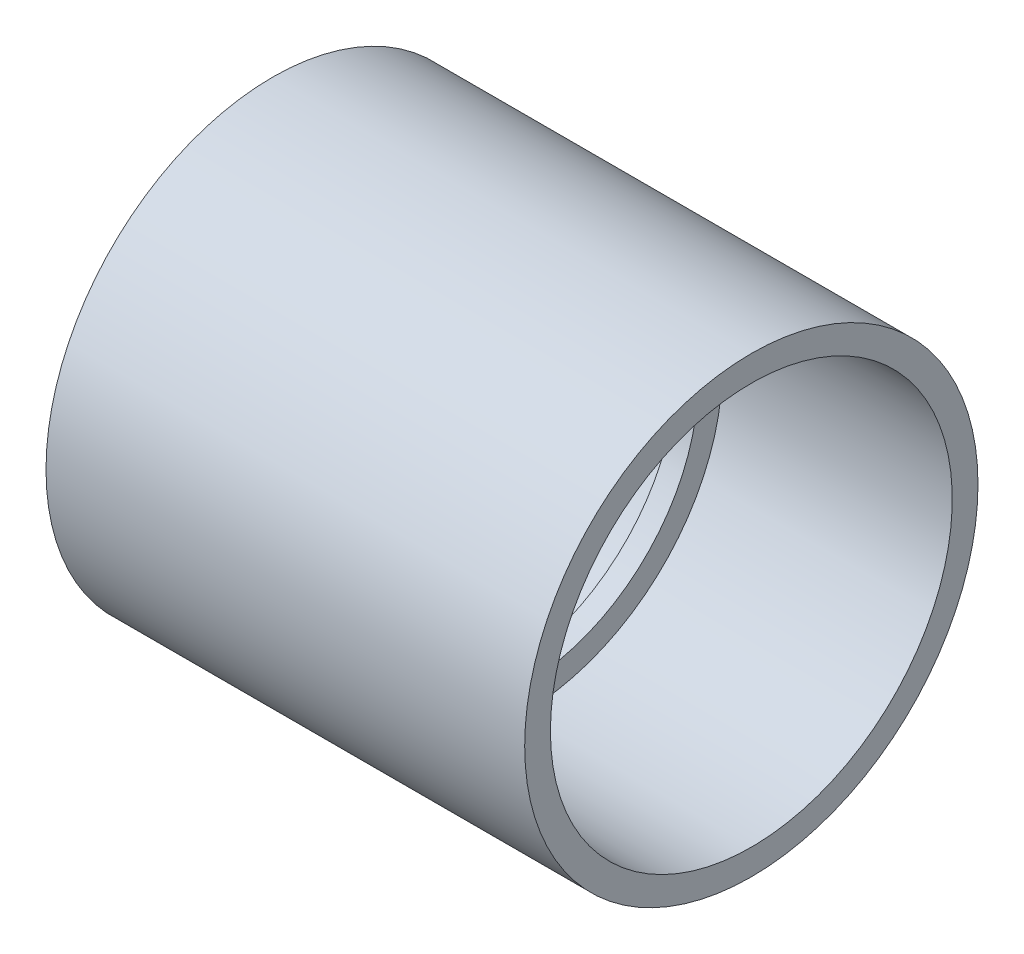
ISO-10303-21;
HEADER;
FILE_DESCRIPTION(('STEP AP214'),'2;1');
FILE_NAME('part.step','',(''),(''),'','','');
FILE_SCHEMA(('AUTOMOTIVE_DESIGN { 1 0 10303 214 1 1 1 1 }'));
ENDSEC;
DATA;
#1=APPLICATION_CONTEXT('core data for automotive mechanical design processes');
#2=APPLICATION_PROTOCOL_DEFINITION('international standard','automotive_design',2000,#1);
#3=PRODUCT_CONTEXT('',#1,'mechanical');
#4=PRODUCT('Part','Part','',(#3));
#5=PRODUCT_RELATED_PRODUCT_CATEGORY('part','',(#4));
#6=PRODUCT_DEFINITION_FORMATION('','',#4);
#7=PRODUCT_DEFINITION_CONTEXT('part definition',#1,'design');
#8=PRODUCT_DEFINITION('design','',#6,#7);
#9=PRODUCT_DEFINITION_SHAPE('','',#8);
#10=(LENGTH_UNIT() NAMED_UNIT(*) SI_UNIT(.MILLI.,.METRE.));
#11=(NAMED_UNIT(*) PLANE_ANGLE_UNIT() SI_UNIT($,.RADIAN.));
#12=(NAMED_UNIT(*) SI_UNIT($,.STERADIAN.) SOLID_ANGLE_UNIT());
#13=UNCERTAINTY_MEASURE_WITH_UNIT(LENGTH_MEASURE(1.E-05),#10,'distance_accuracy_value','');
#14=(GEOMETRIC_REPRESENTATION_CONTEXT(3) GLOBAL_UNCERTAINTY_ASSIGNED_CONTEXT((#13)) GLOBAL_UNIT_ASSIGNED_CONTEXT((#10,
#11,#12)) REPRESENTATION_CONTEXT('',''));
#15=CARTESIAN_POINT('',(0.,0.,0.));
#16=DIRECTION('',(0.,0.,1.));
#17=DIRECTION('',(1.,0.,0.));
#18=AXIS2_PLACEMENT_3D('',#15,#16,#17);
#19=CARTESIAN_POINT('',(-53.1876,0.,0.));
#20=DIRECTION('',(-1.,0.,0.));
#21=DIRECTION('',(0.,0.,1.));
#22=AXIS2_PLACEMENT_3D('',#19,#20,#21);
#23=CYLINDRICAL_SURFACE('',#22,50.3682);
#24=CARTESIAN_POINT('',(53.1876,0.,0.));
#25=DIRECTION('',(-1.,0.,0.));
#26=DIRECTION('',(0.,0.,1.));
#27=AXIS2_PLACEMENT_3D('',#24,#25,#26);
#28=CIRCLE('',#27,50.3682);
#29=CARTESIAN_POINT('',(53.1876,0.,50.3682));
#30=VERTEX_POINT('',#29);
#31=EDGE_CURVE('E58',#30,#30,#28,.T.);
#32=ORIENTED_EDGE('',*,*,#31,.T.);
#33=EDGE_LOOP('',(#32));
#34=FACE_BOUND('',#33,.T.);
#35=CARTESIAN_POINT('',(-53.1876,0.,0.));
#36=DIRECTION('',(-1.,0.,0.));
#37=DIRECTION('',(0.,0.,1.));
#38=AXIS2_PLACEMENT_3D('',#35,#36,#37);
#39=CIRCLE('',#38,50.3682);
#40=CARTESIAN_POINT('',(-53.1876,0.,50.3682));
#41=VERTEX_POINT('',#40);
#42=EDGE_CURVE('E10',#41,#41,#39,.T.);
#43=ORIENTED_EDGE('',*,*,#42,.F.);
#44=EDGE_LOOP('',(#43));
#45=FACE_BOUND('',#44,.T.);
#46=ADVANCED_FACE('F30',(#34,#45),#23,.T.);
#47=CARTESIAN_POINT('',(-53.1876,-50.3682,0.));
#48=DIRECTION('',(-1.,0.,0.));
#49=DIRECTION('',(0.,0.,1.));
#50=AXIS2_PLACEMENT_3D('',#47,#48,#49);
#51=PLANE('',#50);
#52=ORIENTED_EDGE('',*,*,#42,.T.);
#53=EDGE_LOOP('',(#52));
#54=FACE_BOUND('',#53,.T.);
#55=CARTESIAN_POINT('',(-53.1876,0.,0.));
#56=DIRECTION('',(-1.,0.,0.));
#57=DIRECTION('',(0.,0.,1.));
#58=AXIS2_PLACEMENT_3D('',#55,#56,#57);
#59=CIRCLE('',#58,44.6532);
#60=CARTESIAN_POINT('',(-53.1876,0.,44.6532));
#61=VERTEX_POINT('',#60);
#62=EDGE_CURVE('E36',#61,#61,#59,.T.);
#63=ORIENTED_EDGE('',*,*,#62,.F.);
#64=EDGE_LOOP('',(#63));
#65=FACE_BOUND('',#64,.T.);
#66=ADVANCED_FACE('F76',(#54,#65),#51,.T.);
#67=CARTESIAN_POINT('',(-2.3876,0.,0.));
#68=DIRECTION('',(-1.,0.,0.));
#69=DIRECTION('',(0.,0.,1.));
#70=AXIS2_PLACEMENT_3D('',#67,#68,#69);
#71=CONICAL_SURFACE('',#70,44.3484,0.00599992800155518);
#72=ORIENTED_EDGE('',*,*,#62,.T.);
#73=EDGE_LOOP('',(#72));
#74=FACE_BOUND('',#73,.T.);
#75=CARTESIAN_POINT('',(-2.3876,0.,0.));
#76=DIRECTION('',(-1.,0.,0.));
#77=DIRECTION('',(0.,0.,1.));
#78=AXIS2_PLACEMENT_3D('',#75,#76,#77);
#79=CIRCLE('',#78,44.3484);
#80=CARTESIAN_POINT('',(-2.3876,0.,44.3484));
#81=VERTEX_POINT('',#80);
#82=EDGE_CURVE('E40',#81,#81,#79,.T.);
#83=ORIENTED_EDGE('',*,*,#82,.F.);
#84=EDGE_LOOP('',(#83));
#85=FACE_BOUND('',#84,.T.);
#86=ADVANCED_FACE('F80',(#74,#85),#71,.F.);
#87=CARTESIAN_POINT('',(-2.3876,-44.3484,0.));
#88=DIRECTION('',(-1.,0.,0.));
#89=DIRECTION('',(0.,0.,1.));
#90=AXIS2_PLACEMENT_3D('',#87,#88,#89);
#91=PLANE('',#90);
#92=ORIENTED_EDGE('',*,*,#82,.T.);
#93=EDGE_LOOP('',(#92));
#94=FACE_BOUND('',#93,.T.);
#95=CARTESIAN_POINT('',(-2.3876,0.,0.));
#96=DIRECTION('',(-1.,0.,0.));
#97=DIRECTION('',(0.,0.,1.));
#98=AXIS2_PLACEMENT_3D('',#95,#96,#97);
#99=CIRCLE('',#98,38.9636);
#100=CARTESIAN_POINT('',(-2.3876,0.,38.9636));
#101=VERTEX_POINT('',#100);
#102=EDGE_CURVE('E44',#101,#101,#99,.T.);
#103=ORIENTED_EDGE('',*,*,#102,.F.);
#104=EDGE_LOOP('',(#103));
#105=FACE_BOUND('',#104,.T.);
#106=ADVANCED_FACE('F84',(#94,#105),#91,.T.);
#107=CARTESIAN_POINT('',(-53.1876,0.,0.));
#108=DIRECTION('',(-1.,0.,0.));
#109=DIRECTION('',(0.,0.,1.));
#110=AXIS2_PLACEMENT_3D('',#107,#108,#109);
#111=CYLINDRICAL_SURFACE('',#110,38.9636);
#112=ORIENTED_EDGE('',*,*,#102,.T.);
#113=EDGE_LOOP('',(#112));
#114=FACE_BOUND('',#113,.T.);
#115=CARTESIAN_POINT('',(2.3876,0.,0.));
#116=DIRECTION('',(-1.,0.,0.));
#117=DIRECTION('',(0.,0.,1.));
#118=AXIS2_PLACEMENT_3D('',#115,#116,#117);
#119=CIRCLE('',#118,38.9636);
#120=CARTESIAN_POINT('',(2.3876,0.,38.9636));
#121=VERTEX_POINT('',#120);
#122=EDGE_CURVE('E49',#121,#121,#119,.T.);
#123=ORIENTED_EDGE('',*,*,#122,.F.);
#124=EDGE_LOOP('',(#123));
#125=FACE_BOUND('',#124,.T.);
#126=ADVANCED_FACE('F90',(#114,#125),#111,.F.);
#127=CARTESIAN_POINT('',(2.38760000000001,-44.3484,0.));
#128=DIRECTION('',(1.,0.,0.));
#129=DIRECTION('',(0.,0.,-1.));
#130=AXIS2_PLACEMENT_3D('',#127,#128,#129);
#131=PLANE('',#130);
#132=ORIENTED_EDGE('',*,*,#122,.T.);
#133=EDGE_LOOP('',(#132));
#134=FACE_BOUND('',#133,.T.);
#135=CARTESIAN_POINT('',(2.3876,0.,0.));
#136=DIRECTION('',(-1.,0.,0.));
#137=DIRECTION('',(0.,0.,1.));
#138=AXIS2_PLACEMENT_3D('',#135,#136,#137);
#139=CIRCLE('',#138,44.3484);
#140=CARTESIAN_POINT('',(2.3876,0.,44.3484));
#141=VERTEX_POINT('',#140);
#142=EDGE_CURVE('E52',#141,#141,#139,.T.);
#143=ORIENTED_EDGE('',*,*,#142,.F.);
#144=EDGE_LOOP('',(#143));
#145=FACE_BOUND('',#144,.T.);
#146=ADVANCED_FACE('F72',(#134,#145),#131,.T.);
#147=CARTESIAN_POINT('',(53.1876,0.,0.));
#148=DIRECTION('',(1.,0.,0.));
#149=DIRECTION('',(0.,0.,-1.));
#150=AXIS2_PLACEMENT_3D('',#147,#148,#149);
#151=CONICAL_SURFACE('',#150,44.6532,0.0059999280015549);
#152=ORIENTED_EDGE('',*,*,#142,.T.);
#153=EDGE_LOOP('',(#152));
#154=FACE_BOUND('',#153,.T.);
#155=CARTESIAN_POINT('',(53.1876,0.,0.));
#156=DIRECTION('',(-1.,0.,0.));
#157=DIRECTION('',(0.,0.,1.));
#158=AXIS2_PLACEMENT_3D('',#155,#156,#157);
#159=CIRCLE('',#158,44.6532);
#160=CARTESIAN_POINT('',(53.1876,0.,44.6532));
#161=VERTEX_POINT('',#160);
#162=EDGE_CURVE('E55',#161,#161,#159,.T.);
#163=ORIENTED_EDGE('',*,*,#162,.F.);
#164=EDGE_LOOP('',(#163));
#165=FACE_BOUND('',#164,.T.);
#166=ADVANCED_FACE('F66',(#154,#165),#151,.F.);
#167=CARTESIAN_POINT('',(53.1876,-50.3682,0.));
#168=DIRECTION('',(1.,0.,0.));
#169=DIRECTION('',(0.,0.,-1.));
#170=AXIS2_PLACEMENT_3D('',#167,#168,#169);
#171=PLANE('',#170);
#172=ORIENTED_EDGE('',*,*,#162,.T.);
#173=EDGE_LOOP('',(#172));
#174=FACE_BOUND('',#173,.T.);
#175=ORIENTED_EDGE('',*,*,#31,.F.);
#176=EDGE_LOOP('',(#175));
#177=FACE_BOUND('',#176,.T.);
#178=ADVANCED_FACE('F64',(#174,#177),#171,.T.);
#179=CLOSED_SHELL('',(#46,#66,#86,#106,#126,#146,#166,#178));
#180=MANIFOLD_SOLID_BREP('B2',#179);
#181=ADVANCED_BREP_SHAPE_REPRESENTATION('',(#18,#180),#14);
#182=SHAPE_DEFINITION_REPRESENTATION(#9,#181);
ENDSEC;
END-ISO-10303-21;
